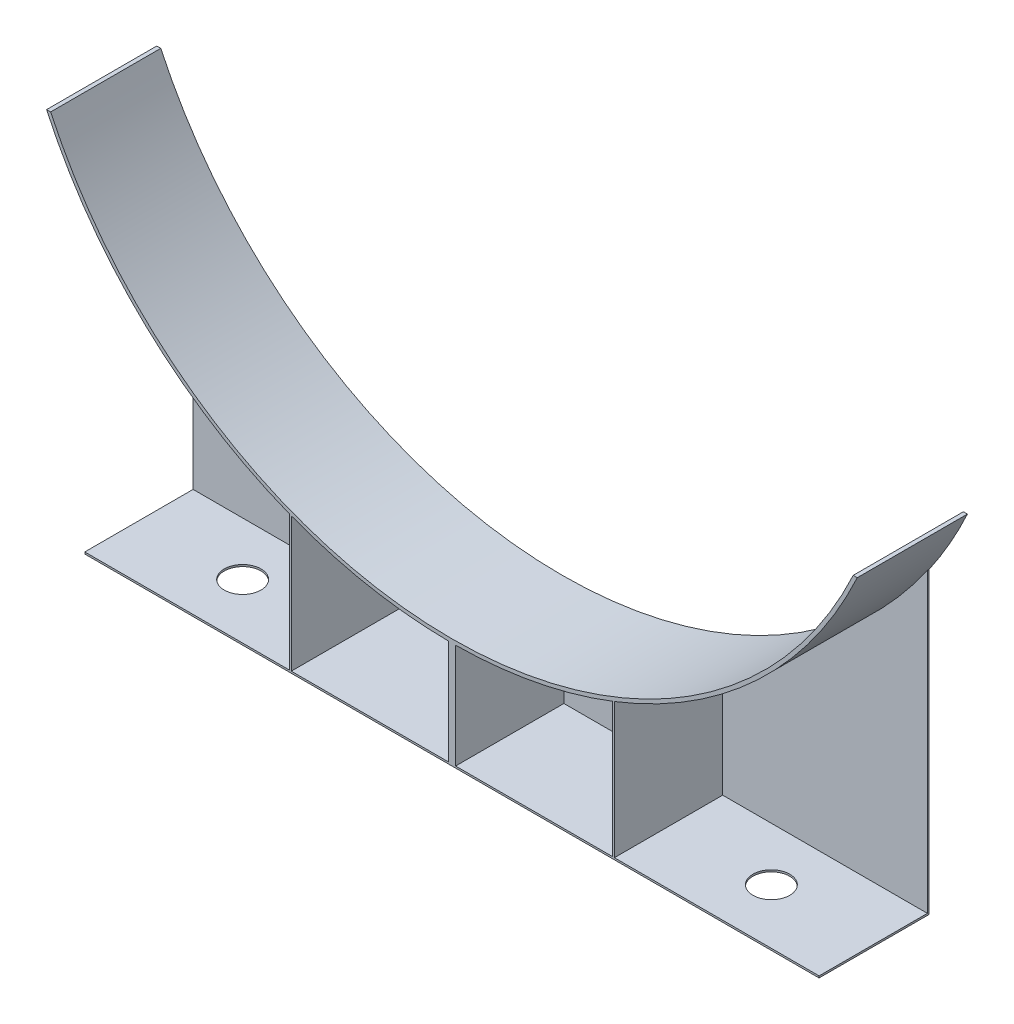
ISO-10303-21;
HEADER;
FILE_DESCRIPTION(('STEP AP214'),'2;1');
FILE_NAME('part.step','',(''),(''),'','','');
FILE_SCHEMA(('AUTOMOTIVE_DESIGN { 1 0 10303 214 1 1 1 1 }'));
ENDSEC;
DATA;
#1=APPLICATION_CONTEXT('core data for automotive mechanical design processes');
#2=APPLICATION_PROTOCOL_DEFINITION('international standard','automotive_design',2000,#1);
#3=PRODUCT_CONTEXT('',#1,'mechanical');
#4=PRODUCT('Part','Part','',(#3));
#5=PRODUCT_RELATED_PRODUCT_CATEGORY('part','',(#4));
#6=PRODUCT_DEFINITION_FORMATION('','',#4);
#7=PRODUCT_DEFINITION_CONTEXT('part definition',#1,'design');
#8=PRODUCT_DEFINITION('design','',#6,#7);
#9=PRODUCT_DEFINITION_SHAPE('','',#8);
#10=(LENGTH_UNIT() NAMED_UNIT(*) SI_UNIT(.MILLI.,.METRE.));
#11=(NAMED_UNIT(*) PLANE_ANGLE_UNIT() SI_UNIT($,.RADIAN.));
#12=(NAMED_UNIT(*) SI_UNIT($,.STERADIAN.) SOLID_ANGLE_UNIT());
#13=UNCERTAINTY_MEASURE_WITH_UNIT(LENGTH_MEASURE(1.E-05),#10,'distance_accuracy_value','');
#14=(GEOMETRIC_REPRESENTATION_CONTEXT(3) GLOBAL_UNCERTAINTY_ASSIGNED_CONTEXT((#13)) GLOBAL_UNIT_ASSIGNED_CONTEXT((#10,
#11,#12)) REPRESENTATION_CONTEXT('',''));
#15=CARTESIAN_POINT('',(0.,0.,0.));
#16=DIRECTION('',(0.,0.,1.));
#17=DIRECTION('',(1.,0.,0.));
#18=AXIS2_PLACEMENT_3D('',#15,#16,#17);
#19=CARTESIAN_POINT('',(0.,574.905099231247,96.3175129560713));
#20=DIRECTION('',(0.,0.,-1.));
#21=DIRECTION('',(-1.,0.,0.));
#22=AXIS2_PLACEMENT_3D('',#19,#20,#21);
#23=CYLINDRICAL_SURFACE('',#22,617.728);
#24=DIRECTION('',(0.,0.,-1.));
#25=VECTOR('',#24,1.);
#26=CARTESIAN_POINT('',(-508.,223.445454344384,-53.5424870439287));
#27=LINE('',#26,#25);
#28=CARTESIAN_POINT('',(-508.,223.445454344384,-53.5424870439287));
#29=VERTEX_POINT('',#28);
#30=CARTESIAN_POINT('',(-508.,223.445454344384,-56.0824870439287));
#31=VERTEX_POINT('',#30);
#32=EDGE_CURVE('E263',#29,#31,#27,.T.);
#33=ORIENTED_EDGE('',*,*,#32,.F.);
#34=CARTESIAN_POINT('',(0.,574.905099231247,-53.5424870439287));
#35=DIRECTION('',(0.,0.,-1.));
#36=DIRECTION('',(1.,0.,0.));
#37=AXIS2_PLACEMENT_3D('',#34,#35,#36);
#38=CIRCLE('',#37,617.728);
#39=CARTESIAN_POINT('',(-224.79,-0.470723934794207,-53.5424870439287));
#40=VERTEX_POINT('',#39);
#41=EDGE_CURVE('E250',#40,#29,#38,.T.);
#42=ORIENTED_EDGE('',*,*,#41,.F.);
#43=DIRECTION('',(0.,0.,-1.));
#44=VECTOR('',#43,1.);
#45=CARTESIAN_POINT('',(-224.79,-0.470723934794207,96.3175129560713));
#46=LINE('',#45,#44);
#47=CARTESIAN_POINT('',(-224.79,-0.470723934794207,96.3175129560713));
#48=VERTEX_POINT('',#47);
#49=EDGE_CURVE('E288',#48,#40,#46,.T.);
#50=ORIENTED_EDGE('',*,*,#49,.F.);
#51=CARTESIAN_POINT('',(0.,574.905099231247,96.3175129560713));
#52=DIRECTION('',(0.,0.,1.));
#53=DIRECTION('',(1.,0.,0.));
#54=AXIS2_PLACEMENT_3D('',#51,#52,#53);
#55=CIRCLE('',#54,617.728);
#56=CARTESIAN_POINT('',(-560.847810343289,315.988866412333,96.3175129560713));
#57=VERTEX_POINT('',#56);
#58=EDGE_CURVE('E322',#57,#48,#55,.T.);
#59=ORIENTED_EDGE('',*,*,#58,.F.);
#60=DIRECTION('',(0.,0.,-1.));
#61=VECTOR('',#60,1.);
#62=CARTESIAN_POINT('',(-560.847810343289,315.988866412333,96.3175129560713));
#63=LINE('',#62,#61);
#64=CARTESIAN_POINT('',(-560.847810343289,315.988866412333,-56.0824870439287));
#65=VERTEX_POINT('',#64);
#66=EDGE_CURVE('E45',#57,#65,#63,.T.);
#67=ORIENTED_EDGE('',*,*,#66,.T.);
#68=CARTESIAN_POINT('',(0.,574.905099231247,-56.0824870439287));
#69=DIRECTION('',(0.,0.,1.));
#70=DIRECTION('',(1.,0.,0.));
#71=AXIS2_PLACEMENT_3D('',#68,#69,#70);
#72=CIRCLE('',#71,617.728);
#73=EDGE_CURVE('E337',#65,#31,#72,.T.);
#74=ORIENTED_EDGE('',*,*,#73,.T.);
#75=EDGE_LOOP('',(#33,#42,#50,#59,#67,#74));
#76=FACE_BOUND('',#75,.T.);
#77=ADVANCED_FACE('F36',(#76),#23,.T.);
#78=DIRECTION('',(0.,0.,-1.));
#79=VECTOR('',#78,1.);
#80=CARTESIAN_POINT('',(508.,223.445454344384,-53.5424870439287));
#81=LINE('',#80,#79);
#82=CARTESIAN_POINT('',(508.,223.445454344384,-53.5424870439287));
#83=VERTEX_POINT('',#82);
#84=CARTESIAN_POINT('',(508.,223.445454344384,-56.0824870439287));
#85=VERTEX_POINT('',#84);
#86=EDGE_CURVE('E266',#83,#85,#81,.T.);
#87=ORIENTED_EDGE('',*,*,#86,.T.);
#88=CARTESIAN_POINT('',(560.847810343289,315.988866412333,-56.0824870439287));
#89=VERTEX_POINT('',#88);
#90=EDGE_CURVE('E336',#85,#89,#72,.T.);
#91=ORIENTED_EDGE('',*,*,#90,.T.);
#92=DIRECTION('',(0.,0.,-1.));
#93=VECTOR('',#92,1.);
#94=CARTESIAN_POINT('',(560.847810343289,315.988866412333,96.3175129560713));
#95=LINE('',#94,#93);
#96=CARTESIAN_POINT('',(560.847810343289,315.988866412333,96.3175129560713));
#97=VERTEX_POINT('',#96);
#98=EDGE_CURVE('E347',#97,#89,#95,.T.);
#99=ORIENTED_EDGE('',*,*,#98,.F.);
#100=CARTESIAN_POINT('',(224.79,-0.470723934794207,96.3175129560713));
#101=VERTEX_POINT('',#100);
#102=EDGE_CURVE('E320',#101,#97,#55,.T.);
#103=ORIENTED_EDGE('',*,*,#102,.F.);
#104=DIRECTION('',(0.,0.,-1.));
#105=VECTOR('',#104,1.);
#106=CARTESIAN_POINT('',(224.79,-0.470723934794207,96.3175129560713));
#107=LINE('',#106,#105);
#108=CARTESIAN_POINT('',(224.79,-0.470723934794207,-53.5424870439287));
#109=VERTEX_POINT('',#108);
#110=EDGE_CURVE('E299',#101,#109,#107,.T.);
#111=ORIENTED_EDGE('',*,*,#110,.T.);
#112=EDGE_CURVE('E252',#83,#109,#38,.T.);
#113=ORIENTED_EDGE('',*,*,#112,.F.);
#114=EDGE_LOOP('',(#87,#91,#99,#103,#111,#113));
#115=FACE_BOUND('',#114,.T.);
#116=ADVANCED_FACE('F396',(#115),#23,.T.);
#117=DIRECTION('',(0.,0.,-1.));
#118=VECTOR('',#117,1.);
#119=CARTESIAN_POINT('',(-222.25,-1.45660966690624,96.3175129560713));
#120=LINE('',#119,#118);
#121=CARTESIAN_POINT('',(-222.25,-1.45660966690632,96.3175129560713));
#122=VERTEX_POINT('',#121);
#123=CARTESIAN_POINT('',(-222.25,-1.45660966690624,-53.5424870439287));
#124=VERTEX_POINT('',#123);
#125=EDGE_CURVE('E291',#122,#124,#120,.T.);
#126=ORIENTED_EDGE('',*,*,#125,.T.);
#127=CARTESIAN_POINT('',(-5.08000000000016,-42.8020122576847,-53.5424870439287));
#128=VERTEX_POINT('',#127);
#129=EDGE_CURVE('E427',#128,#124,#38,.T.);
#130=ORIENTED_EDGE('',*,*,#129,.F.);
#131=DIRECTION('',(0.,0.,-1.));
#132=VECTOR('',#131,1.);
#133=CARTESIAN_POINT('',(-5.08000000000016,-42.8020122576847,96.3175129560713));
#134=LINE('',#133,#132);
#135=CARTESIAN_POINT('',(-5.08000000000016,-42.8020122576847,96.3175129560713));
#136=VERTEX_POINT('',#135);
#137=EDGE_CURVE('E313',#136,#128,#134,.T.);
#138=ORIENTED_EDGE('',*,*,#137,.F.);
#139=EDGE_CURVE('E326',#122,#136,#55,.T.);
#140=ORIENTED_EDGE('',*,*,#139,.F.);
#141=EDGE_LOOP('',(#126,#130,#138,#140));
#142=FACE_BOUND('',#141,.T.);
#143=ADVANCED_FACE('F455',(#142),#23,.T.);
#144=DIRECTION('',(0.,0.,-1.));
#145=VECTOR('',#144,1.);
#146=CARTESIAN_POINT('',(5.08000000000006,-42.8020122576846,96.3175129560713));
#147=LINE('',#146,#145);
#148=CARTESIAN_POINT('',(5.08000000000006,-42.8020122576847,96.3175129560713));
#149=VERTEX_POINT('',#148);
#150=CARTESIAN_POINT('',(5.08000000000006,-42.8020122576846,-53.5424870439287));
#151=VERTEX_POINT('',#150);
#152=EDGE_CURVE('E309',#149,#151,#147,.T.);
#153=ORIENTED_EDGE('',*,*,#152,.T.);
#154=CARTESIAN_POINT('',(222.25,-1.45660966690624,-53.5424870439287));
#155=VERTEX_POINT('',#154);
#156=EDGE_CURVE('E256',#155,#151,#38,.T.);
#157=ORIENTED_EDGE('',*,*,#156,.F.);
#158=DIRECTION('',(0.,0.,-1.));
#159=VECTOR('',#158,1.);
#160=CARTESIAN_POINT('',(222.25,-1.45660966690624,96.3175129560713));
#161=LINE('',#160,#159);
#162=CARTESIAN_POINT('',(222.25,-1.45660966690624,96.3175129560713));
#163=VERTEX_POINT('',#162);
#164=EDGE_CURVE('E302',#163,#155,#161,.T.);
#165=ORIENTED_EDGE('',*,*,#164,.F.);
#166=EDGE_CURVE('E327',#149,#163,#55,.T.);
#167=ORIENTED_EDGE('',*,*,#166,.F.);
#168=EDGE_LOOP('',(#153,#157,#165,#167));
#169=FACE_BOUND('',#168,.T.);
#170=ADVANCED_FACE('F437',(#169),#23,.T.);
#171=CARTESIAN_POINT('',(-555.24765311243,315.988866412333,96.3175129560713));
#172=DIRECTION('',(0.,-1.,0.));
#173=DIRECTION('',(0.,0.,-1.));
#174=AXIS2_PLACEMENT_3D('',#171,#172,#173);
#175=PLANE('',#174);
#176=DIRECTION('',(-1.,0.,0.));
#177=VECTOR('',#176,1.);
#178=CARTESIAN_POINT('',(-555.24765311243,315.988866412333,-56.0824870439287));
#179=LINE('',#178,#177);
#180=CARTESIAN_POINT('',(-555.24765311243,315.988866412333,-56.0824870439287));
#181=VERTEX_POINT('',#180);
#182=EDGE_CURVE('E316',#181,#65,#179,.T.);
#183=ORIENTED_EDGE('',*,*,#182,.T.);
#184=ORIENTED_EDGE('',*,*,#66,.F.);
#185=DIRECTION('',(-1.,0.,0.));
#186=VECTOR('',#185,1.);
#187=CARTESIAN_POINT('',(-555.24765311243,315.988866412333,96.3175129560713));
#188=LINE('',#187,#186);
#189=CARTESIAN_POINT('',(-555.24765311243,315.988866412333,96.3175129560713));
#190=VERTEX_POINT('',#189);
#191=EDGE_CURVE('E317',#190,#57,#188,.T.);
#192=ORIENTED_EDGE('',*,*,#191,.F.);
#193=DIRECTION('',(0.,0.,-1.));
#194=VECTOR('',#193,1.);
#195=CARTESIAN_POINT('',(-555.24765311243,315.988866412333,96.3175129560713));
#196=LINE('',#195,#194);
#197=EDGE_CURVE('E333',#190,#181,#196,.T.);
#198=ORIENTED_EDGE('',*,*,#197,.T.);
#199=EDGE_LOOP('',(#183,#184,#192,#198));
#200=FACE_BOUND('',#199,.T.);
#201=ADVANCED_FACE('F38',(#200),#175,.F.);
#202=CARTESIAN_POINT('',(555.24765311243,315.988866412333,96.3175129560713));
#203=DIRECTION('',(0.,1.,0.));
#204=DIRECTION('',(0.,0.,1.));
#205=AXIS2_PLACEMENT_3D('',#202,#203,#204);
#206=PLANE('',#205);
#207=DIRECTION('',(1.,0.,0.));
#208=VECTOR('',#207,1.);
#209=CARTESIAN_POINT('',(555.24765311243,315.988866412333,-56.0824870439287));
#210=LINE('',#209,#208);
#211=CARTESIAN_POINT('',(555.24765311243,315.988866412333,-56.0824870439287));
#212=VERTEX_POINT('',#211);
#213=EDGE_CURVE('E339',#212,#89,#210,.T.);
#214=ORIENTED_EDGE('',*,*,#213,.F.);
#215=DIRECTION('',(0.,0.,-1.));
#216=VECTOR('',#215,1.);
#217=CARTESIAN_POINT('',(555.24765311243,315.988866412333,96.3175129560713));
#218=LINE('',#217,#216);
#219=CARTESIAN_POINT('',(555.24765311243,315.988866412333,96.3175129560713));
#220=VERTEX_POINT('',#219);
#221=EDGE_CURVE('E345',#220,#212,#218,.T.);
#222=ORIENTED_EDGE('',*,*,#221,.F.);
#223=DIRECTION('',(1.,0.,0.));
#224=VECTOR('',#223,1.);
#225=CARTESIAN_POINT('',(555.24765311243,315.988866412333,96.3175129560713));
#226=LINE('',#225,#224);
#227=EDGE_CURVE('E325',#220,#97,#226,.T.);
#228=ORIENTED_EDGE('',*,*,#227,.T.);
#229=ORIENTED_EDGE('',*,*,#98,.T.);
#230=EDGE_LOOP('',(#214,#222,#228,#229));
#231=FACE_BOUND('',#230,.T.);
#232=ADVANCED_FACE('F405',(#231),#206,.T.);
#233=CARTESIAN_POINT('',(0.,574.905099231247,96.3175129560713));
#234=DIRECTION('',(0.,0.,-1.));
#235=DIRECTION('',(-1.,0.,0.));
#236=AXIS2_PLACEMENT_3D('',#233,#234,#235);
#237=CYLINDRICAL_SURFACE('',#236,612.648);
#238=CARTESIAN_POINT('',(0.,574.905099231247,-56.0824870439287));
#239=DIRECTION('',(0.,0.,1.));
#240=DIRECTION('',(1.,0.,0.));
#241=AXIS2_PLACEMENT_3D('',#238,#239,#240);
#242=CIRCLE('',#241,612.648);
#243=EDGE_CURVE('E321',#181,#212,#242,.T.);
#244=ORIENTED_EDGE('',*,*,#243,.F.);
#245=ORIENTED_EDGE('',*,*,#197,.F.);
#246=CARTESIAN_POINT('',(0.,574.905099231247,96.3175129560713));
#247=DIRECTION('',(0.,0.,1.));
#248=DIRECTION('',(1.,0.,0.));
#249=AXIS2_PLACEMENT_3D('',#246,#247,#248);
#250=CIRCLE('',#249,612.648);
#251=EDGE_CURVE('E330',#190,#220,#250,.T.);
#252=ORIENTED_EDGE('',*,*,#251,.T.);
#253=ORIENTED_EDGE('',*,*,#221,.T.);
#254=EDGE_LOOP('',(#244,#245,#252,#253));
#255=FACE_BOUND('',#254,.T.);
#256=ADVANCED_FACE('F410',(#255),#237,.F.);
#257=CARTESIAN_POINT('',(0.,574.905099231247,96.3175129560713));
#258=DIRECTION('',(0.,0.,1.));
#259=DIRECTION('',(1.,0.,0.));
#260=AXIS2_PLACEMENT_3D('',#257,#258,#259);
#261=PLANE('',#260);
#262=DIRECTION('',(0.,-1.,0.));
#263=VECTOR('',#262,1.);
#264=CARTESIAN_POINT('',(222.25,-190.142900768752,96.3175129560713));
#265=LINE('',#264,#263);
#266=CARTESIAN_POINT('',(222.25,-187.602900768753,96.3175129560713));
#267=VERTEX_POINT('',#266);
#268=EDGE_CURVE('E294',#163,#267,#265,.T.);
#269=ORIENTED_EDGE('',*,*,#268,.T.);
#270=DIRECTION('',(-1.,0.,0.));
#271=VECTOR('',#270,1.);
#272=CARTESIAN_POINT('',(508.,-187.602900768753,96.3175129560713));
#273=LINE('',#272,#271);
#274=CARTESIAN_POINT('',(5.08000000000004,-187.602900768752,96.3175129560713));
#275=VERTEX_POINT('',#274);
#276=EDGE_CURVE('E215',#267,#275,#273,.T.);
#277=ORIENTED_EDGE('',*,*,#276,.T.);
#278=DIRECTION('',(0.,1.,0.));
#279=VECTOR('',#278,1.);
#280=CARTESIAN_POINT('',(5.08000000000006,-42.8020122576846,96.3175129560713));
#281=LINE('',#280,#279);
#282=EDGE_CURVE('E61',#275,#149,#281,.T.);
#283=ORIENTED_EDGE('',*,*,#282,.T.);
#284=ORIENTED_EDGE('',*,*,#166,.T.);
#285=EDGE_LOOP('',(#269,#277,#283,#284));
#286=FACE_BOUND('',#285,.T.);
#287=DIRECTION('',(0.,-1.,0.));
#288=VECTOR('',#287,1.);
#289=CARTESIAN_POINT('',(-5.08000000000016,-42.8020122576847,96.3175129560713));
#290=LINE('',#289,#288);
#291=CARTESIAN_POINT('',(-5.08000000000016,-187.602900768753,96.3175129560713));
#292=VERTEX_POINT('',#291);
#293=EDGE_CURVE('E229',#136,#292,#290,.T.);
#294=ORIENTED_EDGE('',*,*,#293,.T.);
#295=CARTESIAN_POINT('',(-222.25,-187.602900768753,96.3175129560713));
#296=VERTEX_POINT('',#295);
#297=EDGE_CURVE('E220',#292,#296,#273,.T.);
#298=ORIENTED_EDGE('',*,*,#297,.T.);
#299=DIRECTION('',(0.,1.,0.));
#300=VECTOR('',#299,1.);
#301=CARTESIAN_POINT('',(-222.25,-190.142900768752,96.3175129560713));
#302=LINE('',#301,#300);
#303=EDGE_CURVE('E227',#296,#122,#302,.T.);
#304=ORIENTED_EDGE('',*,*,#303,.T.);
#305=ORIENTED_EDGE('',*,*,#139,.T.);
#306=EDGE_LOOP('',(#294,#298,#304,#305));
#307=FACE_BOUND('',#306,.T.);
#308=CARTESIAN_POINT('',(508.,-187.602900768753,96.3175129560713));
#309=VERTEX_POINT('',#308);
#310=CARTESIAN_POINT('',(224.79,-187.602900768753,96.3175129560713));
#311=VERTEX_POINT('',#310);
#312=EDGE_CURVE('E205',#309,#311,#273,.T.);
#313=ORIENTED_EDGE('',*,*,#312,.T.);
#314=DIRECTION('',(0.,1.,0.));
#315=VECTOR('',#314,1.);
#316=CARTESIAN_POINT('',(224.79,-190.142900768752,96.3175129560713));
#317=LINE('',#316,#315);
#318=EDGE_CURVE('E297',#311,#101,#317,.T.);
#319=ORIENTED_EDGE('',*,*,#318,.T.);
#320=ORIENTED_EDGE('',*,*,#102,.T.);
#321=ORIENTED_EDGE('',*,*,#227,.F.);
#322=ORIENTED_EDGE('',*,*,#251,.F.);
#323=ORIENTED_EDGE('',*,*,#191,.T.);
#324=ORIENTED_EDGE('',*,*,#58,.T.);
#325=DIRECTION('',(0.,-1.,0.));
#326=VECTOR('',#325,1.);
#327=CARTESIAN_POINT('',(-224.79,-190.142900768752,96.3175129560713));
#328=LINE('',#327,#326);
#329=CARTESIAN_POINT('',(-224.79,-187.602900768753,96.3175129560713));
#330=VERTEX_POINT('',#329);
#331=EDGE_CURVE('E286',#48,#330,#328,.T.);
#332=ORIENTED_EDGE('',*,*,#331,.T.);
#333=CARTESIAN_POINT('',(-508.,-187.602900768753,96.3175129560713));
#334=VERTEX_POINT('',#333);
#335=EDGE_CURVE('E200',#330,#334,#273,.T.);
#336=ORIENTED_EDGE('',*,*,#335,.T.);
#337=DIRECTION('',(0.,-1.,0.));
#338=VECTOR('',#337,1.);
#339=CARTESIAN_POINT('',(-508.,-187.602900768753,96.3175129560713));
#340=LINE('',#339,#338);
#341=CARTESIAN_POINT('',(-508.,-190.142900768752,96.3175129560713));
#342=VERTEX_POINT('',#341);
#343=EDGE_CURVE('E209',#334,#342,#340,.T.);
#344=ORIENTED_EDGE('',*,*,#343,.T.);
#345=DIRECTION('',(1.,0.,0.));
#346=VECTOR('',#345,1.);
#347=CARTESIAN_POINT('',(-5.08000000000016,-190.142900768752,96.3175129560713));
#348=LINE('',#347,#346);
#349=CARTESIAN_POINT('',(508.,-190.142900768752,96.3175129560713));
#350=VERTEX_POINT('',#349);
#351=EDGE_CURVE('E207',#342,#350,#348,.T.);
#352=ORIENTED_EDGE('',*,*,#351,.T.);
#353=DIRECTION('',(0.,-1.,0.));
#354=VECTOR('',#353,1.);
#355=CARTESIAN_POINT('',(508.,-187.602900768753,96.3175129560713));
#356=LINE('',#355,#354);
#357=EDGE_CURVE('E194',#309,#350,#356,.T.);
#358=ORIENTED_EDGE('',*,*,#357,.F.);
#359=EDGE_LOOP('',(#313,#319,#320,#321,#322,#323,#324,#332,#336,#344,#352,#358));
#360=FACE_BOUND('',#359,.T.);
#361=ADVANCED_FACE('F204',(#286,#307,#360),#261,.T.);
#362=CARTESIAN_POINT('',(0.,574.905099231247,-56.0824870439287));
#363=DIRECTION('',(0.,0.,1.));
#364=DIRECTION('',(1.,0.,0.));
#365=AXIS2_PLACEMENT_3D('',#362,#363,#364);
#366=PLANE('',#365);
#367=ORIENTED_EDGE('',*,*,#90,.F.);
#368=DIRECTION('',(0.,1.,0.));
#369=VECTOR('',#368,1.);
#370=CARTESIAN_POINT('',(508.,-190.142900768752,-56.0824870439287));
#371=LINE('',#370,#369);
#372=CARTESIAN_POINT('',(508.,-190.142900768752,-56.0824870439287));
#373=VERTEX_POINT('',#372);
#374=EDGE_CURVE('E248',#373,#85,#371,.T.);
#375=ORIENTED_EDGE('',*,*,#374,.F.);
#376=DIRECTION('',(1.,0.,0.));
#377=VECTOR('',#376,1.);
#378=CARTESIAN_POINT('',(-5.08000000000016,-190.142900768752,-56.0824870439287));
#379=LINE('',#378,#377);
#380=CARTESIAN_POINT('',(-508.,-190.142900768752,-56.0824870439287));
#381=VERTEX_POINT('',#380);
#382=EDGE_CURVE('E305',#381,#373,#379,.T.);
#383=ORIENTED_EDGE('',*,*,#382,.F.);
#384=DIRECTION('',(0.,-1.,0.));
#385=VECTOR('',#384,1.);
#386=CARTESIAN_POINT('',(-508.,-190.142900768752,-56.0824870439287));
#387=LINE('',#386,#385);
#388=EDGE_CURVE('E251',#31,#381,#387,.T.);
#389=ORIENTED_EDGE('',*,*,#388,.F.);
#390=ORIENTED_EDGE('',*,*,#73,.F.);
#391=ORIENTED_EDGE('',*,*,#182,.F.);
#392=ORIENTED_EDGE('',*,*,#243,.T.);
#393=ORIENTED_EDGE('',*,*,#213,.T.);
#394=EDGE_LOOP('',(#367,#375,#383,#389,#390,#391,#392,#393));
#395=FACE_BOUND('',#394,.T.);
#396=ADVANCED_FACE('F401',(#395),#366,.F.);
#397=CARTESIAN_POINT('',(-5.08000000000016,-42.8020122576847,96.3175129560713));
#398=DIRECTION('',(1.,0.,0.));
#399=DIRECTION('',(0.,0.,-1.));
#400=AXIS2_PLACEMENT_3D('',#397,#398,#399);
#401=PLANE('',#400);
#402=DIRECTION('',(0.,-1.,0.));
#403=VECTOR('',#402,1.);
#404=CARTESIAN_POINT('',(-5.08000000000016,-42.8020122576847,-53.5424870439287));
#405=LINE('',#404,#403);
#406=CARTESIAN_POINT('',(-5.08000000000016,-187.602900768753,-53.5424870439287));
#407=VERTEX_POINT('',#406);
#408=EDGE_CURVE('E283',#128,#407,#405,.T.);
#409=ORIENTED_EDGE('',*,*,#408,.T.);
#410=DIRECTION('',(0.,0.,1.));
#411=VECTOR('',#410,1.);
#412=CARTESIAN_POINT('',(-5.08000000000016,-187.602900768753,96.3175129560713));
#413=LINE('',#412,#411);
#414=EDGE_CURVE('E53',#407,#292,#413,.T.);
#415=ORIENTED_EDGE('',*,*,#414,.T.);
#416=ORIENTED_EDGE('',*,*,#293,.F.);
#417=ORIENTED_EDGE('',*,*,#137,.T.);
#418=EDGE_LOOP('',(#409,#415,#416,#417));
#419=FACE_BOUND('',#418,.T.);
#420=ADVANCED_FACE('F372',(#419),#401,.F.);
#421=CARTESIAN_POINT('',(-5.08000000000016,-190.142900768752,96.3175129560713));
#422=DIRECTION('',(0.,1.,0.));
#423=DIRECTION('',(0.,0.,1.));
#424=AXIS2_PLACEMENT_3D('',#421,#422,#423);
#425=PLANE('',#424);
#426=CARTESIAN_POINT('',(-365.76,-190.142900768752,20.1175129560713));
#427=DIRECTION('',(0.,-1.,0.));
#428=DIRECTION('',(0.,0.,-1.));
#429=AXIS2_PLACEMENT_3D('',#426,#427,#428);
#430=CIRCLE('',#429,25.4);
#431=CARTESIAN_POINT('',(-365.76,-190.142900768752,-5.28248704392872));
#432=VERTEX_POINT('',#431);
#433=EDGE_CURVE('E353',#432,#432,#430,.T.);
#434=ORIENTED_EDGE('',*,*,#433,.F.);
#435=EDGE_LOOP('',(#434));
#436=FACE_BOUND('',#435,.T.);
#437=CARTESIAN_POINT('',(365.76,-190.142900768752,20.1175129560713));
#438=DIRECTION('',(0.,-1.,0.));
#439=DIRECTION('',(0.,0.,-1.));
#440=AXIS2_PLACEMENT_3D('',#437,#438,#439);
#441=CIRCLE('',#440,25.4);
#442=CARTESIAN_POINT('',(365.76,-190.142900768752,-5.28248704392874));
#443=VERTEX_POINT('',#442);
#444=EDGE_CURVE('E358',#443,#443,#441,.T.);
#445=ORIENTED_EDGE('',*,*,#444,.F.);
#446=EDGE_LOOP('',(#445));
#447=FACE_BOUND('',#446,.T.);
#448=ORIENTED_EDGE('',*,*,#351,.F.);
#449=DIRECTION('',(0.,0.,-1.));
#450=VECTOR('',#449,1.);
#451=CARTESIAN_POINT('',(-508.,-190.142900768752,-53.5424870439287));
#452=LINE('',#451,#450);
#453=EDGE_CURVE('E258',#342,#381,#452,.T.);
#454=ORIENTED_EDGE('',*,*,#453,.T.);
#455=ORIENTED_EDGE('',*,*,#382,.T.);
#456=DIRECTION('',(0.,0.,-1.));
#457=VECTOR('',#456,1.);
#458=CARTESIAN_POINT('',(508.,-190.142900768752,-53.5424870439287));
#459=LINE('',#458,#457);
#460=EDGE_CURVE('E269',#350,#373,#459,.T.);
#461=ORIENTED_EDGE('',*,*,#460,.F.);
#462=EDGE_LOOP('',(#448,#454,#455,#461));
#463=FACE_BOUND('',#462,.T.);
#464=ADVANCED_FACE('F368',(#436,#447,#463),#425,.F.);
#465=CARTESIAN_POINT('',(5.08000000000006,-42.8020122576846,96.3175129560713));
#466=DIRECTION('',(-1.,0.,0.));
#467=DIRECTION('',(0.,-1.,0.));
#468=AXIS2_PLACEMENT_3D('',#465,#466,#467);
#469=PLANE('',#468);
#470=ORIENTED_EDGE('',*,*,#282,.F.);
#471=DIRECTION('',(0.,0.,-1.));
#472=VECTOR('',#471,1.);
#473=CARTESIAN_POINT('',(5.08000000000004,-187.602900768753,96.3175129560713));
#474=LINE('',#473,#472);
#475=CARTESIAN_POINT('',(5.08000000000004,-187.602900768753,-53.5424870439287));
#476=VERTEX_POINT('',#475);
#477=EDGE_CURVE('E383',#275,#476,#474,.T.);
#478=ORIENTED_EDGE('',*,*,#477,.T.);
#479=DIRECTION('',(0.,1.,0.));
#480=VECTOR('',#479,1.);
#481=CARTESIAN_POINT('',(5.08000000000006,-42.8020122576846,-53.5424870439287));
#482=LINE('',#481,#480);
#483=EDGE_CURVE('E281',#476,#151,#482,.T.);
#484=ORIENTED_EDGE('',*,*,#483,.T.);
#485=ORIENTED_EDGE('',*,*,#152,.F.);
#486=EDGE_LOOP('',(#470,#478,#484,#485));
#487=FACE_BOUND('',#486,.T.);
#488=ADVANCED_FACE('F371',(#487),#469,.F.);
#489=CARTESIAN_POINT('',(222.25,-190.142900768752,96.3175129560713));
#490=DIRECTION('',(1.,0.,0.));
#491=DIRECTION('',(0.,0.,-1.));
#492=AXIS2_PLACEMENT_3D('',#489,#490,#491);
#493=PLANE('',#492);
#494=DIRECTION('',(0.,-1.,0.));
#495=VECTOR('',#494,1.);
#496=CARTESIAN_POINT('',(222.25,-190.142900768752,-53.5424870439287));
#497=LINE('',#496,#495);
#498=CARTESIAN_POINT('',(222.25,-187.602900768753,-53.5424870439287));
#499=VERTEX_POINT('',#498);
#500=EDGE_CURVE('E278',#155,#499,#497,.T.);
#501=ORIENTED_EDGE('',*,*,#500,.T.);
#502=DIRECTION('',(0.,0.,1.));
#503=VECTOR('',#502,1.);
#504=CARTESIAN_POINT('',(222.25,-187.602900768753,96.3175129560713));
#505=LINE('',#504,#503);
#506=EDGE_CURVE('E381',#499,#267,#505,.T.);
#507=ORIENTED_EDGE('',*,*,#506,.T.);
#508=ORIENTED_EDGE('',*,*,#268,.F.);
#509=ORIENTED_EDGE('',*,*,#164,.T.);
#510=EDGE_LOOP('',(#501,#507,#508,#509));
#511=FACE_BOUND('',#510,.T.);
#512=ADVANCED_FACE('F442',(#511),#493,.F.);
#513=CARTESIAN_POINT('',(224.79,-190.142900768752,96.3175129560713));
#514=DIRECTION('',(-1.,0.,0.));
#515=DIRECTION('',(0.,0.,1.));
#516=AXIS2_PLACEMENT_3D('',#513,#514,#515);
#517=PLANE('',#516);
#518=ORIENTED_EDGE('',*,*,#318,.F.);
#519=DIRECTION('',(0.,0.,-1.));
#520=VECTOR('',#519,1.);
#521=CARTESIAN_POINT('',(224.79,-187.602900768753,96.3175129560713));
#522=LINE('',#521,#520);
#523=CARTESIAN_POINT('',(224.79,-187.602900768753,-53.5424870439287));
#524=VERTEX_POINT('',#523);
#525=EDGE_CURVE('E214',#311,#524,#522,.T.);
#526=ORIENTED_EDGE('',*,*,#525,.T.);
#527=DIRECTION('',(0.,1.,0.));
#528=VECTOR('',#527,1.);
#529=CARTESIAN_POINT('',(224.79,-190.142900768752,-53.5424870439287));
#530=LINE('',#529,#528);
#531=EDGE_CURVE('E276',#524,#109,#530,.T.);
#532=ORIENTED_EDGE('',*,*,#531,.T.);
#533=ORIENTED_EDGE('',*,*,#110,.F.);
#534=EDGE_LOOP('',(#518,#526,#532,#533));
#535=FACE_BOUND('',#534,.T.);
#536=ADVANCED_FACE('F390',(#535),#517,.F.);
#537=CARTESIAN_POINT('',(-222.25,-190.142900768752,96.3175129560713));
#538=DIRECTION('',(-1.,0.,0.));
#539=DIRECTION('',(0.,0.,1.));
#540=AXIS2_PLACEMENT_3D('',#537,#538,#539);
#541=PLANE('',#540);
#542=ORIENTED_EDGE('',*,*,#303,.F.);
#543=DIRECTION('',(0.,0.,-1.));
#544=VECTOR('',#543,1.);
#545=CARTESIAN_POINT('',(-222.25,-187.602900768753,96.3175129560713));
#546=LINE('',#545,#544);
#547=CARTESIAN_POINT('',(-222.25,-187.602900768753,-53.5424870439287));
#548=VERTEX_POINT('',#547);
#549=EDGE_CURVE('E234',#296,#548,#546,.T.);
#550=ORIENTED_EDGE('',*,*,#549,.T.);
#551=DIRECTION('',(0.,1.,0.));
#552=VECTOR('',#551,1.);
#553=CARTESIAN_POINT('',(-222.25,-190.142900768752,-53.5424870439287));
#554=LINE('',#553,#552);
#555=EDGE_CURVE('E274',#548,#124,#554,.T.);
#556=ORIENTED_EDGE('',*,*,#555,.T.);
#557=ORIENTED_EDGE('',*,*,#125,.F.);
#558=EDGE_LOOP('',(#542,#550,#556,#557));
#559=FACE_BOUND('',#558,.T.);
#560=ADVANCED_FACE('F467',(#559),#541,.F.);
#561=CARTESIAN_POINT('',(-224.79,-190.142900768752,96.3175129560713));
#562=DIRECTION('',(1.,0.,0.));
#563=DIRECTION('',(0.,0.,-1.));
#564=AXIS2_PLACEMENT_3D('',#561,#562,#563);
#565=PLANE('',#564);
#566=DIRECTION('',(0.,-1.,0.));
#567=VECTOR('',#566,1.);
#568=CARTESIAN_POINT('',(-224.79,-190.142900768752,-53.5424870439287));
#569=LINE('',#568,#567);
#570=CARTESIAN_POINT('',(-224.79,-187.602900768753,-53.5424870439287));
#571=VERTEX_POINT('',#570);
#572=EDGE_CURVE('E271',#40,#571,#569,.T.);
#573=ORIENTED_EDGE('',*,*,#572,.T.);
#574=DIRECTION('',(0.,0.,1.));
#575=VECTOR('',#574,1.);
#576=CARTESIAN_POINT('',(-224.79,-187.602900768753,96.3175129560713));
#577=LINE('',#576,#575);
#578=EDGE_CURVE('E246',#571,#330,#577,.T.);
#579=ORIENTED_EDGE('',*,*,#578,.T.);
#580=ORIENTED_EDGE('',*,*,#331,.F.);
#581=ORIENTED_EDGE('',*,*,#49,.T.);
#582=EDGE_LOOP('',(#573,#579,#580,#581));
#583=FACE_BOUND('',#582,.T.);
#584=ADVANCED_FACE('F418',(#583),#565,.F.);
#585=CARTESIAN_POINT('',(0.,574.905099231247,-53.5424870439287));
#586=DIRECTION('',(0.,0.,1.));
#587=DIRECTION('',(1.,0.,0.));
#588=AXIS2_PLACEMENT_3D('',#585,#586,#587);
#589=PLANE('',#588);
#590=DIRECTION('',(-1.,0.,0.));
#591=VECTOR('',#590,1.);
#592=CARTESIAN_POINT('',(0.,-187.602900768753,-53.5424870439287));
#593=LINE('',#592,#591);
#594=CARTESIAN_POINT('',(-508.,-187.602900768753,-53.5424870439287));
#595=VERTEX_POINT('',#594);
#596=EDGE_CURVE('E239',#571,#595,#593,.T.);
#597=ORIENTED_EDGE('',*,*,#596,.F.);
#598=ORIENTED_EDGE('',*,*,#572,.F.);
#599=ORIENTED_EDGE('',*,*,#41,.T.);
#600=DIRECTION('',(0.,-1.,0.));
#601=VECTOR('',#600,1.);
#602=CARTESIAN_POINT('',(-508.,-190.142900768752,-53.5424870439287));
#603=LINE('',#602,#601);
#604=EDGE_CURVE('E255',#29,#595,#603,.T.);
#605=ORIENTED_EDGE('',*,*,#604,.T.);
#606=EDGE_LOOP('',(#597,#598,#599,#605));
#607=FACE_BOUND('',#606,.T.);
#608=ADVANCED_FACE('F426',(#607),#589,.T.);
#609=CARTESIAN_POINT('',(-508.,-190.142900768752,-53.5424870439287));
#610=DIRECTION('',(1.,0.,0.));
#611=DIRECTION('',(0.,0.,-1.));
#612=AXIS2_PLACEMENT_3D('',#609,#610,#611);
#613=PLANE('',#612);
#614=ORIENTED_EDGE('',*,*,#388,.T.);
#615=ORIENTED_EDGE('',*,*,#453,.F.);
#616=ORIENTED_EDGE('',*,*,#343,.F.);
#617=DIRECTION('',(0.,0.,-1.));
#618=VECTOR('',#617,1.);
#619=CARTESIAN_POINT('',(-508.,-187.602900768753,-56.0824870439287));
#620=LINE('',#619,#618);
#621=EDGE_CURVE('E210',#334,#595,#620,.T.);
#622=ORIENTED_EDGE('',*,*,#621,.T.);
#623=ORIENTED_EDGE('',*,*,#604,.F.);
#624=ORIENTED_EDGE('',*,*,#32,.T.);
#625=EDGE_LOOP('',(#614,#615,#616,#622,#623,#624));
#626=FACE_BOUND('',#625,.T.);
#627=ADVANCED_FACE('F377',(#626),#613,.F.);
#628=DIRECTION('',(-1.,0.,0.));
#629=VECTOR('',#628,1.);
#630=CARTESIAN_POINT('',(0.,-187.602900768753,-53.5424870439287));
#631=LINE('',#630,#629);
#632=EDGE_CURVE('E235',#407,#548,#631,.T.);
#633=ORIENTED_EDGE('',*,*,#632,.F.);
#634=ORIENTED_EDGE('',*,*,#408,.F.);
#635=ORIENTED_EDGE('',*,*,#129,.T.);
#636=ORIENTED_EDGE('',*,*,#555,.F.);
#637=EDGE_LOOP('',(#633,#634,#635,#636));
#638=FACE_BOUND('',#637,.T.);
#639=ADVANCED_FACE('F468',(#638),#589,.T.);
#640=DIRECTION('',(-1.,0.,0.));
#641=VECTOR('',#640,1.);
#642=CARTESIAN_POINT('',(0.,-187.602900768753,-53.5424870439287));
#643=LINE('',#642,#641);
#644=CARTESIAN_POINT('',(508.,-187.602900768753,-53.5424870439287));
#645=VERTEX_POINT('',#644);
#646=EDGE_CURVE('E387',#645,#524,#643,.T.);
#647=ORIENTED_EDGE('',*,*,#646,.F.);
#648=DIRECTION('',(0.,1.,0.));
#649=VECTOR('',#648,1.);
#650=CARTESIAN_POINT('',(508.,-190.142900768752,-53.5424870439287));
#651=LINE('',#650,#649);
#652=EDGE_CURVE('E196',#645,#83,#651,.T.);
#653=ORIENTED_EDGE('',*,*,#652,.T.);
#654=ORIENTED_EDGE('',*,*,#112,.T.);
#655=ORIENTED_EDGE('',*,*,#531,.F.);
#656=EDGE_LOOP('',(#647,#653,#654,#655));
#657=FACE_BOUND('',#656,.T.);
#658=ADVANCED_FACE('F393',(#657),#589,.T.);
#659=CARTESIAN_POINT('',(508.,-190.142900768752,-53.5424870439287));
#660=DIRECTION('',(-1.,0.,0.));
#661=DIRECTION('',(0.,0.,1.));
#662=AXIS2_PLACEMENT_3D('',#659,#660,#661);
#663=PLANE('',#662);
#664=ORIENTED_EDGE('',*,*,#652,.F.);
#665=DIRECTION('',(0.,0.,1.));
#666=VECTOR('',#665,1.);
#667=CARTESIAN_POINT('',(508.,-187.602900768753,-56.0824870439287));
#668=LINE('',#667,#666);
#669=EDGE_CURVE('E190',#645,#309,#668,.T.);
#670=ORIENTED_EDGE('',*,*,#669,.T.);
#671=ORIENTED_EDGE('',*,*,#357,.T.);
#672=ORIENTED_EDGE('',*,*,#460,.T.);
#673=ORIENTED_EDGE('',*,*,#374,.T.);
#674=ORIENTED_EDGE('',*,*,#86,.F.);
#675=EDGE_LOOP('',(#664,#670,#671,#672,#673,#674));
#676=FACE_BOUND('',#675,.T.);
#677=ADVANCED_FACE('F192',(#676),#663,.F.);
#678=DIRECTION('',(-1.,0.,0.));
#679=VECTOR('',#678,1.);
#680=CARTESIAN_POINT('',(0.,-187.602900768753,-53.5424870439287));
#681=LINE('',#680,#679);
#682=EDGE_CURVE('E11',#499,#476,#681,.T.);
#683=ORIENTED_EDGE('',*,*,#682,.F.);
#684=ORIENTED_EDGE('',*,*,#500,.F.);
#685=ORIENTED_EDGE('',*,*,#156,.T.);
#686=ORIENTED_EDGE('',*,*,#483,.F.);
#687=EDGE_LOOP('',(#683,#684,#685,#686));
#688=FACE_BOUND('',#687,.T.);
#689=ADVANCED_FACE('F435',(#688),#589,.T.);
#690=CARTESIAN_POINT('',(0.,-187.602900768753,-56.0824870439287));
#691=DIRECTION('',(0.,1.,0.));
#692=DIRECTION('',(0.,0.,1.));
#693=AXIS2_PLACEMENT_3D('',#690,#691,#692);
#694=PLANE('',#693);
#695=ORIENTED_EDGE('',*,*,#477,.F.);
#696=ORIENTED_EDGE('',*,*,#276,.F.);
#697=ORIENTED_EDGE('',*,*,#506,.F.);
#698=ORIENTED_EDGE('',*,*,#682,.T.);
#699=EDGE_LOOP('',(#695,#696,#697,#698));
#700=FACE_BOUND('',#699,.T.);
#701=ADVANCED_FACE('F447',(#700),#694,.T.);
#702=CARTESIAN_POINT('',(365.76,-187.602900768753,20.1175129560713));
#703=DIRECTION('',(0.,1.,0.));
#704=DIRECTION('',(0.,0.,1.));
#705=AXIS2_PLACEMENT_3D('',#702,#703,#704);
#706=CIRCLE('',#705,25.4);
#707=CARTESIAN_POINT('',(365.76,-187.602900768753,45.5175129560713));
#708=VERTEX_POINT('',#707);
#709=EDGE_CURVE('E40',#708,#708,#706,.T.);
#710=ORIENTED_EDGE('',*,*,#709,.F.);
#711=EDGE_LOOP('',(#710));
#712=FACE_BOUND('',#711,.T.);
#713=ORIENTED_EDGE('',*,*,#525,.F.);
#714=ORIENTED_EDGE('',*,*,#312,.F.);
#715=ORIENTED_EDGE('',*,*,#669,.F.);
#716=ORIENTED_EDGE('',*,*,#646,.T.);
#717=EDGE_LOOP('',(#713,#714,#715,#716));
#718=FACE_BOUND('',#717,.T.);
#719=ADVANCED_FACE('F213',(#712,#718),#694,.T.);
#720=ORIENTED_EDGE('',*,*,#414,.F.);
#721=ORIENTED_EDGE('',*,*,#632,.T.);
#722=ORIENTED_EDGE('',*,*,#549,.F.);
#723=ORIENTED_EDGE('',*,*,#297,.F.);
#724=EDGE_LOOP('',(#720,#721,#722,#723));
#725=FACE_BOUND('',#724,.T.);
#726=ADVANCED_FACE('F232',(#725),#694,.T.);
#727=CARTESIAN_POINT('',(-365.76,-187.602900768753,20.1175129560713));
#728=DIRECTION('',(0.,1.,0.));
#729=DIRECTION('',(0.,0.,1.));
#730=AXIS2_PLACEMENT_3D('',#727,#728,#729);
#731=CIRCLE('',#730,25.4);
#732=CARTESIAN_POINT('',(-365.76,-187.602900768753,45.5175129560714));
#733=VERTEX_POINT('',#732);
#734=EDGE_CURVE('E351',#733,#733,#731,.T.);
#735=ORIENTED_EDGE('',*,*,#734,.F.);
#736=EDGE_LOOP('',(#735));
#737=FACE_BOUND('',#736,.T.);
#738=ORIENTED_EDGE('',*,*,#578,.F.);
#739=ORIENTED_EDGE('',*,*,#596,.T.);
#740=ORIENTED_EDGE('',*,*,#621,.F.);
#741=ORIENTED_EDGE('',*,*,#335,.F.);
#742=EDGE_LOOP('',(#738,#739,#740,#741));
#743=FACE_BOUND('',#742,.T.);
#744=ADVANCED_FACE('F422',(#737,#743),#694,.T.);
#745=CARTESIAN_POINT('',(-365.76,-162.202900768752,20.1175129560713));
#746=DIRECTION('',(0.,-1.,0.));
#747=DIRECTION('',(0.,0.,-1.));
#748=AXIS2_PLACEMENT_3D('',#745,#746,#747);
#749=CYLINDRICAL_SURFACE('',#748,25.4);
#750=ORIENTED_EDGE('',*,*,#734,.T.);
#751=EDGE_LOOP('',(#750));
#752=FACE_BOUND('',#751,.T.);
#753=ORIENTED_EDGE('',*,*,#433,.T.);
#754=EDGE_LOOP('',(#753));
#755=FACE_BOUND('',#754,.T.);
#756=ADVANCED_FACE('F655',(#752,#755),#749,.F.);
#757=CARTESIAN_POINT('',(365.76,-162.202900768752,20.1175129560713));
#758=DIRECTION('',(0.,-1.,0.));
#759=DIRECTION('',(0.,0.,-1.));
#760=AXIS2_PLACEMENT_3D('',#757,#758,#759);
#761=CYLINDRICAL_SURFACE('',#760,25.4);
#762=ORIENTED_EDGE('',*,*,#709,.T.);
#763=EDGE_LOOP('',(#762));
#764=FACE_BOUND('',#763,.T.);
#765=ORIENTED_EDGE('',*,*,#444,.T.);
#766=EDGE_LOOP('',(#765));
#767=FACE_BOUND('',#766,.T.);
#768=ADVANCED_FACE('F366',(#764,#767),#761,.F.);
#769=CLOSED_SHELL('',(#77,#116,#143,#170,#201,#232,#256,#361,#396,#420,#464,#488,#512,#536,#560,
#584,#608,#627,#639,#658,#677,#689,#701,#719,#726,#744,#756,#768));
#770=MANIFOLD_SOLID_BREP('B2',#769);
#771=ADVANCED_BREP_SHAPE_REPRESENTATION('',(#18,#770),#14);
#772=SHAPE_DEFINITION_REPRESENTATION(#9,#771);
ENDSEC;
END-ISO-10303-21;
